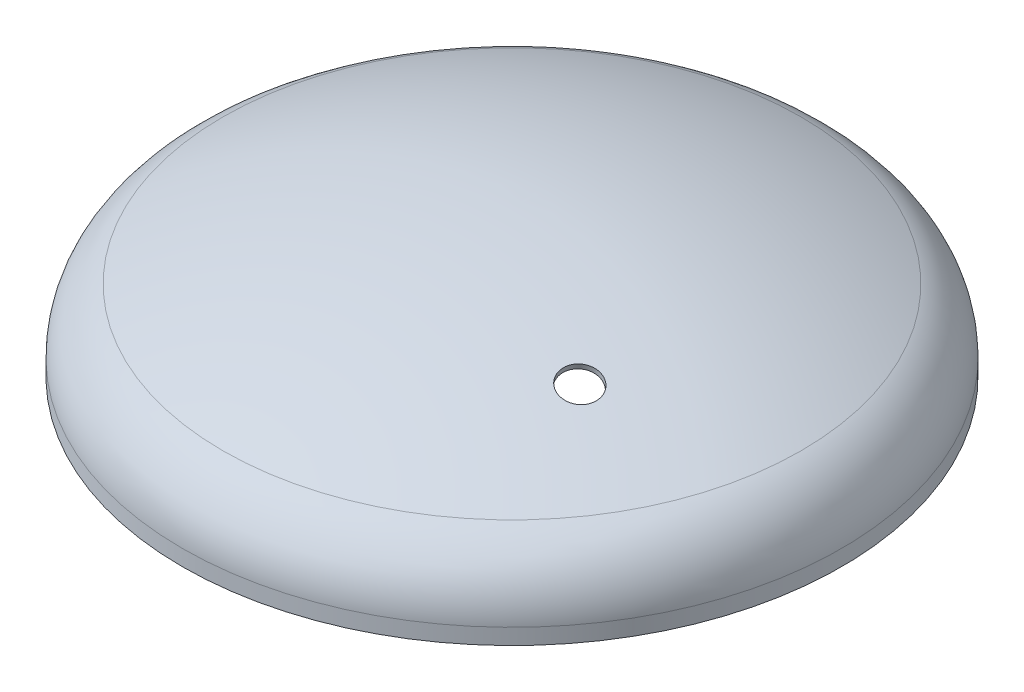
ISO-10303-21;
HEADER;
FILE_DESCRIPTION(('STEP AP214'),'2;1');
FILE_NAME('part.step','',(''),(''),'','','');
FILE_SCHEMA(('AUTOMOTIVE_DESIGN { 1 0 10303 214 1 1 1 1 }'));
ENDSEC;
DATA;
#1=APPLICATION_CONTEXT('core data for automotive mechanical design processes');
#2=APPLICATION_PROTOCOL_DEFINITION('international standard','automotive_design',2000,#1);
#3=PRODUCT_CONTEXT('',#1,'mechanical');
#4=PRODUCT('Part','Part','',(#3));
#5=PRODUCT_RELATED_PRODUCT_CATEGORY('part','',(#4));
#6=PRODUCT_DEFINITION_FORMATION('','',#4);
#7=PRODUCT_DEFINITION_CONTEXT('part definition',#1,'design');
#8=PRODUCT_DEFINITION('design','',#6,#7);
#9=PRODUCT_DEFINITION_SHAPE('','',#8);
#10=(LENGTH_UNIT() NAMED_UNIT(*) SI_UNIT(.MILLI.,.METRE.));
#11=(NAMED_UNIT(*) PLANE_ANGLE_UNIT() SI_UNIT($,.RADIAN.));
#12=(NAMED_UNIT(*) SI_UNIT($,.STERADIAN.) SOLID_ANGLE_UNIT());
#13=UNCERTAINTY_MEASURE_WITH_UNIT(LENGTH_MEASURE(1.E-05),#10,'distance_accuracy_value','');
#14=(GEOMETRIC_REPRESENTATION_CONTEXT(3) GLOBAL_UNCERTAINTY_ASSIGNED_CONTEXT((#13)) GLOBAL_UNIT_ASSIGNED_CONTEXT((#10,
#11,#12)) REPRESENTATION_CONTEXT('',''));
#15=CARTESIAN_POINT('',(0.,0.,0.));
#16=DIRECTION('',(0.,0.,1.));
#17=DIRECTION('',(1.,0.,0.));
#18=AXIS2_PLACEMENT_3D('',#15,#16,#17);
#19=CARTESIAN_POINT('',(0.,0.,-174.8));
#20=DIRECTION('',(0.,1.,0.));
#21=DIRECTION('',(0.,0.,1.));
#22=AXIS2_PLACEMENT_3D('',#19,#20,#21);
#23=PLANE('',#22);
#24=CARTESIAN_POINT('',(0.,0.,0.));
#25=DIRECTION('',(0.,1.,0.));
#26=DIRECTION('',(0.,0.,1.));
#27=AXIS2_PLACEMENT_3D('',#24,#25,#26);
#28=CIRCLE('',#27,177.8);
#29=CARTESIAN_POINT('',(0.,0.,177.8));
#30=VERTEX_POINT('',#29);
#31=EDGE_CURVE('E10',#30,#30,#28,.T.);
#32=ORIENTED_EDGE('',*,*,#31,.F.);
#33=EDGE_LOOP('',(#32));
#34=FACE_BOUND('',#33,.T.);
#35=CARTESIAN_POINT('',(0.,0.,0.));
#36=DIRECTION('',(0.,1.,0.));
#37=DIRECTION('',(0.,0.,1.));
#38=AXIS2_PLACEMENT_3D('',#35,#36,#37);
#39=CIRCLE('',#38,174.8);
#40=CARTESIAN_POINT('',(0.,0.,174.8));
#41=VERTEX_POINT('',#40);
#42=EDGE_CURVE('E55',#41,#41,#39,.T.);
#43=ORIENTED_EDGE('',*,*,#42,.T.);
#44=EDGE_LOOP('',(#43));
#45=FACE_BOUND('',#44,.T.);
#46=ADVANCED_FACE('F33',(#34,#45),#23,.F.);
#47=CARTESIAN_POINT('',(0.,44.9075645772685,0.));
#48=DIRECTION('',(0.,1.,0.));
#49=DIRECTION('',(0.,0.,1.));
#50=AXIS2_PLACEMENT_3D('',#47,#48,#49);
#51=CYLINDRICAL_SURFACE('',#50,177.8);
#52=CARTESIAN_POINT('',(0.,8.53774483743014,0.));
#53=DIRECTION('',(0.,1.,0.));
#54=DIRECTION('',(0.,0.,1.));
#55=AXIS2_PLACEMENT_3D('',#52,#53,#54);
#56=CIRCLE('',#55,177.8);
#57=CARTESIAN_POINT('',(0.,8.53774483743014,177.8));
#58=VERTEX_POINT('',#57);
#59=EDGE_CURVE('E39',#58,#58,#56,.T.);
#60=ORIENTED_EDGE('',*,*,#59,.F.);
#61=EDGE_LOOP('',(#60));
#62=FACE_BOUND('',#61,.T.);
#63=ORIENTED_EDGE('',*,*,#31,.T.);
#64=EDGE_LOOP('',(#63));
#65=FACE_BOUND('',#64,.T.);
#66=ADVANCED_FACE('F83',(#62,#65),#51,.T.);
#67=CARTESIAN_POINT('',(0.,8.53774483743014,0.));
#68=DIRECTION('',(0.,1.,0.));
#69=DIRECTION('',(0.,0.,1.));
#70=AXIS2_PLACEMENT_3D('',#67,#68,#69);
#71=TOROIDAL_SURFACE('',#70,139.2,38.6);
#72=CARTESIAN_POINT('',(0.,43.2943603084451,0.));
#73=DIRECTION('',(0.,1.,0.));
#74=DIRECTION('',(0.,0.,1.));
#75=AXIS2_PLACEMENT_3D('',#72,#73,#74);
#76=CIRCLE('',#75,155.991);
#77=CARTESIAN_POINT('',(0.,43.2943603084451,155.991));
#78=VERTEX_POINT('',#77);
#79=EDGE_CURVE('E43',#78,#78,#76,.T.);
#80=ORIENTED_EDGE('',*,*,#79,.F.);
#81=EDGE_LOOP('',(#80));
#82=FACE_BOUND('',#81,.T.);
#83=ORIENTED_EDGE('',*,*,#59,.T.);
#84=EDGE_LOOP('',(#83));
#85=FACE_BOUND('',#84,.T.);
#86=ADVANCED_FACE('F78',(#82,#85),#71,.T.);
#87=CARTESIAN_POINT('',(0.,-279.6,0.));
#88=DIRECTION('',(0.,1.,0.));
#89=DIRECTION('',(0.,0.,-1.));
#90=AXIS2_PLACEMENT_3D('',#87,#88,#89);
#91=SPHERICAL_SURFACE('',#90,358.6);
#92=CARTESIAN_POINT('',(86.568860964823,64.6408116638762,49.9805551814791));
#93=DIRECTION('',(-0.241501785773687,-0.960331114750269,-0.139431121026212));
#94=DIRECTION('',(0.96980438499492,-0.243884101254317,0.));
#95=AXIS2_PLACEMENT_3D('',#92,#93,#94);
#96=CIRCLE('',#95,9.99999999999999);
#97=CARTESIAN_POINT('',(96.2669048147722,62.201970651333,49.9805551814791));
#98=VERTEX_POINT('',#97);
#99=EDGE_CURVE('E58',#98,#98,#96,.T.);
#100=ORIENTED_EDGE('',*,*,#99,.T.);
#101=EDGE_LOOP('',(#100));
#102=FACE_BOUND('',#101,.T.);
#103=ORIENTED_EDGE('',*,*,#79,.T.);
#104=EDGE_LOOP('',(#103));
#105=FACE_BOUND('',#104,.T.);
#106=ADVANCED_FACE('F75',(#102,#105),#91,.T.);
#107=CARTESIAN_POINT('',(0.,-279.6,0.));
#108=DIRECTION('',(0.,1.,0.));
#109=DIRECTION('',(0.,0.,1.));
#110=AXIS2_PLACEMENT_3D('',#107,#108,#109);
#111=SPHERICAL_SURFACE('',#110,355.6);
#112=CARTESIAN_POINT('',(85.8440713610209,61.7586880143602,49.5620977086182));
#113=DIRECTION('',(-0.241501785773687,-0.960331114750269,-0.139431121026212));
#114=DIRECTION('',(0.96980438499492,-0.243884101254317,0.));
#115=AXIS2_PLACEMENT_3D('',#112,#113,#114);
#116=CIRCLE('',#115,9.99999999999999);
#117=CARTESIAN_POINT('',(95.5421152109701,59.319847001817,49.5620977086182));
#118=VERTEX_POINT('',#117);
#119=EDGE_CURVE('E61',#118,#118,#116,.F.);
#120=ORIENTED_EDGE('',*,*,#119,.T.);
#121=EDGE_LOOP('',(#120));
#122=FACE_BOUND('',#121,.T.);
#123=CARTESIAN_POINT('',(0.,40.5930689505943,0.));
#124=DIRECTION('',(0.,1.,0.));
#125=DIRECTION('',(0.,0.,1.));
#126=AXIS2_PLACEMENT_3D('',#123,#124,#125);
#127=CIRCLE('',#126,154.686);
#128=CARTESIAN_POINT('',(0.,40.5930689505943,154.686));
#129=VERTEX_POINT('',#128);
#130=EDGE_CURVE('E47',#129,#129,#127,.T.);
#131=ORIENTED_EDGE('',*,*,#130,.F.);
#132=EDGE_LOOP('',(#131));
#133=FACE_BOUND('',#132,.T.);
#134=ADVANCED_FACE('F65',(#122,#133),#111,.F.);
#135=CARTESIAN_POINT('',(0.,8.53774483743014,0.));
#136=DIRECTION('',(0.,1.,0.));
#137=DIRECTION('',(0.,0.,1.));
#138=AXIS2_PLACEMENT_3D('',#135,#136,#137);
#139=TOROIDAL_SURFACE('',#138,139.2,35.6);
#140=CARTESIAN_POINT('',(0.,8.53774483743014,0.));
#141=DIRECTION('',(0.,1.,0.));
#142=DIRECTION('',(0.,0.,1.));
#143=AXIS2_PLACEMENT_3D('',#140,#141,#142);
#144=CIRCLE('',#143,174.8);
#145=CARTESIAN_POINT('',(0.,8.53774483743014,174.8));
#146=VERTEX_POINT('',#145);
#147=EDGE_CURVE('E52',#146,#146,#144,.T.);
#148=ORIENTED_EDGE('',*,*,#147,.F.);
#149=EDGE_LOOP('',(#148));
#150=FACE_BOUND('',#149,.T.);
#151=ORIENTED_EDGE('',*,*,#130,.T.);
#152=EDGE_LOOP('',(#151));
#153=FACE_BOUND('',#152,.T.);
#154=ADVANCED_FACE('F99',(#150,#153),#139,.F.);
#155=CARTESIAN_POINT('',(0.,44.9075645772685,0.));
#156=DIRECTION('',(0.,1.,0.));
#157=DIRECTION('',(0.,0.,1.));
#158=AXIS2_PLACEMENT_3D('',#155,#156,#157);
#159=CYLINDRICAL_SURFACE('',#158,174.8);
#160=ORIENTED_EDGE('',*,*,#42,.F.);
#161=EDGE_LOOP('',(#160));
#162=FACE_BOUND('',#161,.T.);
#163=ORIENTED_EDGE('',*,*,#147,.T.);
#164=EDGE_LOOP('',(#163));
#165=FACE_BOUND('',#164,.T.);
#166=ADVANCED_FACE('F71',(#162,#165),#159,.F.);
#167=CARTESIAN_POINT('',(86.6025403784442,64.7747377494464,49.9999999999994));
#168=DIRECTION('',(0.241501785773687,0.960331114750269,0.139431121026212));
#169=DIRECTION('',(-0.96980438499492,0.243884101254317,0.));
#170=AXIS2_PLACEMENT_3D('',#167,#168,#169);
#171=CYLINDRICAL_SURFACE('',#170,9.99999999999999);
#172=ORIENTED_EDGE('',*,*,#119,.F.);
#173=EDGE_LOOP('',(#172));
#174=FACE_BOUND('',#173,.T.);
#175=ORIENTED_EDGE('',*,*,#99,.F.);
#176=EDGE_LOOP('',(#175));
#177=FACE_BOUND('',#176,.T.);
#178=ADVANCED_FACE('F68',(#174,#177),#171,.F.);
#179=CLOSED_SHELL('',(#46,#66,#86,#106,#134,#154,#166,#178));
#180=MANIFOLD_SOLID_BREP('B2',#179);
#181=ADVANCED_BREP_SHAPE_REPRESENTATION('',(#18,#180),#14);
#182=SHAPE_DEFINITION_REPRESENTATION(#9,#181);
ENDSEC;
END-ISO-10303-21;
